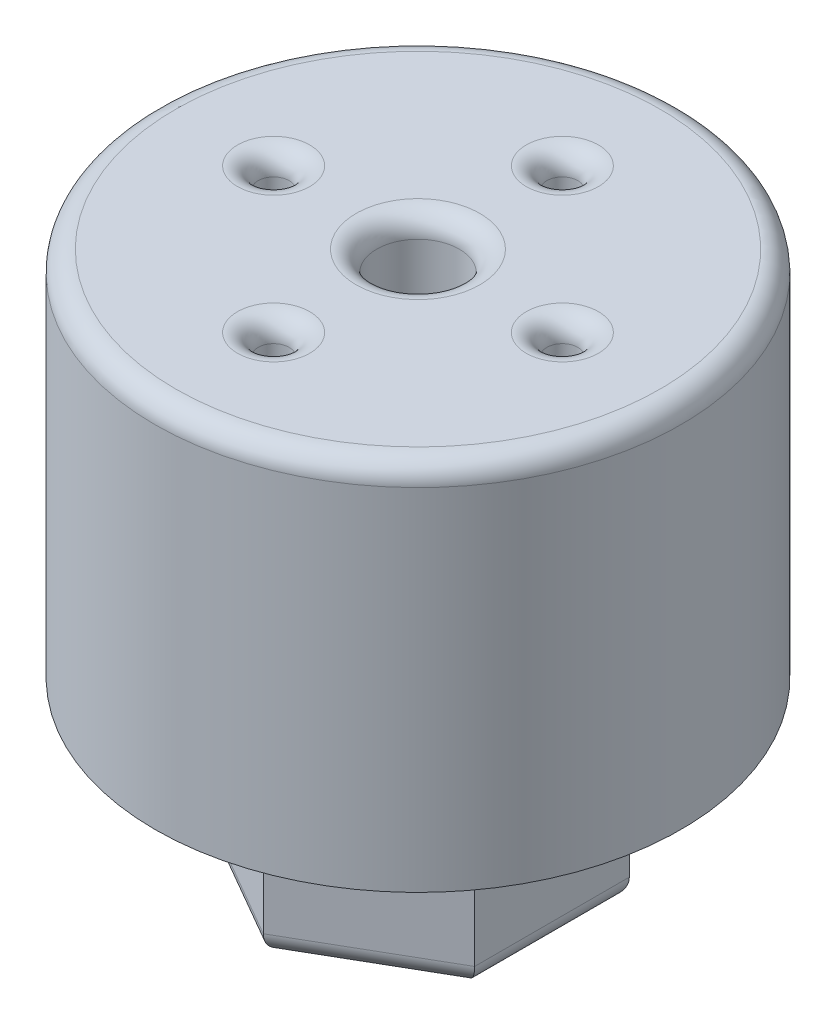
ISO-10303-21;
HEADER;
FILE_DESCRIPTION(('STEP AP214'),'2;1');
FILE_NAME('part.step','',(''),(''),'','','');
FILE_SCHEMA(('AUTOMOTIVE_DESIGN { 1 0 10303 214 1 1 1 1 }'));
ENDSEC;
DATA;
#1=APPLICATION_CONTEXT('core data for automotive mechanical design processes');
#2=APPLICATION_PROTOCOL_DEFINITION('international standard','automotive_design',2000,#1);
#3=PRODUCT_CONTEXT('',#1,'mechanical');
#4=PRODUCT('Part','Part','',(#3));
#5=PRODUCT_RELATED_PRODUCT_CATEGORY('part','',(#4));
#6=PRODUCT_DEFINITION_FORMATION('','',#4);
#7=PRODUCT_DEFINITION_CONTEXT('part definition',#1,'design');
#8=PRODUCT_DEFINITION('design','',#6,#7);
#9=PRODUCT_DEFINITION_SHAPE('','',#8);
#10=(LENGTH_UNIT() NAMED_UNIT(*) SI_UNIT(.MILLI.,.METRE.));
#11=(NAMED_UNIT(*) PLANE_ANGLE_UNIT() SI_UNIT($,.RADIAN.));
#12=(NAMED_UNIT(*) SI_UNIT($,.STERADIAN.) SOLID_ANGLE_UNIT());
#13=UNCERTAINTY_MEASURE_WITH_UNIT(LENGTH_MEASURE(1.E-05),#10,'distance_accuracy_value','');
#14=(GEOMETRIC_REPRESENTATION_CONTEXT(3) GLOBAL_UNCERTAINTY_ASSIGNED_CONTEXT((#13)) GLOBAL_UNIT_ASSIGNED_CONTEXT((#10,
#11,#12)) REPRESENTATION_CONTEXT('',''));
#15=CARTESIAN_POINT('',(0.,0.,0.));
#16=DIRECTION('',(0.,0.,1.));
#17=DIRECTION('',(1.,0.,0.));
#18=AXIS2_PLACEMENT_3D('',#15,#16,#17);
#19=CARTESIAN_POINT('',(0.,18.,-7.));
#20=DIRECTION('',(0.,-1.,0.));
#21=DIRECTION('',(0.,0.,-1.));
#22=AXIS2_PLACEMENT_3D('',#19,#20,#21);
#23=CYLINDRICAL_SURFACE('',#22,0.75);
#24=CARTESIAN_POINT('',(0.,17.,-7.));
#25=DIRECTION('',(0.,1.,0.));
#26=DIRECTION('',(0.,0.,1.));
#27=AXIS2_PLACEMENT_3D('',#24,#25,#26);
#28=CIRCLE('',#27,0.75);
#29=CARTESIAN_POINT('',(0.,17.,-6.25));
#30=VERTEX_POINT('',#29);
#31=EDGE_CURVE('E224',#30,#30,#28,.T.);
#32=ORIENTED_EDGE('',*,*,#31,.T.);
#33=EDGE_LOOP('',(#32));
#34=FACE_BOUND('',#33,.T.);
#35=CARTESIAN_POINT('',(0.,4.,-7.));
#36=DIRECTION('',(0.,-1.,0.));
#37=DIRECTION('',(0.,0.,-1.));
#38=AXIS2_PLACEMENT_3D('',#35,#36,#37);
#39=CIRCLE('',#38,0.75);
#40=CARTESIAN_POINT('',(0.,4.,-7.75));
#41=VERTEX_POINT('',#40);
#42=EDGE_CURVE('E567',#41,#41,#39,.T.);
#43=ORIENTED_EDGE('',*,*,#42,.T.);
#44=EDGE_LOOP('',(#43));
#45=FACE_BOUND('',#44,.T.);
#46=ADVANCED_FACE('F33',(#34,#45),#23,.F.);
#47=CARTESIAN_POINT('',(7.0000000000002,18.,-1.98094713253425E-13));
#48=DIRECTION('',(0.,-1.,0.));
#49=DIRECTION('',(0.,0.,-1.));
#50=AXIS2_PLACEMENT_3D('',#47,#48,#49);
#51=CYLINDRICAL_SURFACE('',#50,0.750000000000155);
#52=CARTESIAN_POINT('',(7.0000000000002,17.,-1.98094713253425E-13));
#53=DIRECTION('',(0.,1.,0.));
#54=DIRECTION('',(0.,0.,1.));
#55=AXIS2_PLACEMENT_3D('',#52,#53,#54);
#56=CIRCLE('',#55,0.750000000000155);
#57=CARTESIAN_POINT('',(7.0000000000002,17.,0.749999999999957));
#58=VERTEX_POINT('',#57);
#59=EDGE_CURVE('E218',#58,#58,#56,.T.);
#60=ORIENTED_EDGE('',*,*,#59,.T.);
#61=EDGE_LOOP('',(#60));
#62=FACE_BOUND('',#61,.T.);
#63=CARTESIAN_POINT('',(7.0000000000002,4.,-1.98094713253425E-13));
#64=DIRECTION('',(0.,-1.,0.));
#65=DIRECTION('',(0.,0.,-1.));
#66=AXIS2_PLACEMENT_3D('',#63,#64,#65);
#67=CIRCLE('',#66,0.750000000000155);
#68=CARTESIAN_POINT('',(7.0000000000002,4.,-0.750000000000353));
#69=VERTEX_POINT('',#68);
#70=EDGE_CURVE('E570',#69,#69,#67,.T.);
#71=ORIENTED_EDGE('',*,*,#70,.T.);
#72=EDGE_LOOP('',(#71));
#73=FACE_BOUND('',#72,.T.);
#74=ADVANCED_FACE('F246',(#62,#73),#51,.F.);
#75=CARTESIAN_POINT('',(3.9618942650685E-13,18.,7.));
#76=DIRECTION('',(0.,-1.,0.));
#77=DIRECTION('',(0.,0.,-1.));
#78=AXIS2_PLACEMENT_3D('',#75,#76,#77);
#79=CYLINDRICAL_SURFACE('',#78,0.750000000000425);
#80=CARTESIAN_POINT('',(3.9618942650685E-13,17.,7.));
#81=DIRECTION('',(0.,1.,0.));
#82=DIRECTION('',(0.,0.,1.));
#83=AXIS2_PLACEMENT_3D('',#80,#81,#82);
#84=CIRCLE('',#83,0.750000000000425);
#85=CARTESIAN_POINT('',(3.9618942650685E-13,17.,7.75000000000043));
#86=VERTEX_POINT('',#85);
#87=EDGE_CURVE('E41',#86,#86,#84,.T.);
#88=ORIENTED_EDGE('',*,*,#87,.T.);
#89=EDGE_LOOP('',(#88));
#90=FACE_BOUND('',#89,.T.);
#91=CARTESIAN_POINT('',(3.9618942650685E-13,4.,7.));
#92=DIRECTION('',(0.,-1.,0.));
#93=DIRECTION('',(0.,0.,-1.));
#94=AXIS2_PLACEMENT_3D('',#91,#92,#93);
#95=CIRCLE('',#94,0.750000000000425);
#96=CARTESIAN_POINT('',(3.9618942650685E-13,4.,6.24999999999957));
#97=VERTEX_POINT('',#96);
#98=EDGE_CURVE('E152',#97,#97,#95,.T.);
#99=ORIENTED_EDGE('',*,*,#98,.T.);
#100=EDGE_LOOP('',(#99));
#101=FACE_BOUND('',#100,.T.);
#102=ADVANCED_FACE('F229',(#90,#101),#79,.F.);
#103=CARTESIAN_POINT('',(-6.9999999999998,18.,1.98951966012828E-13));
#104=DIRECTION('',(0.,-1.,0.));
#105=DIRECTION('',(0.,0.,-1.));
#106=AXIS2_PLACEMENT_3D('',#103,#104,#105);
#107=CYLINDRICAL_SURFACE('',#106,0.750000000000318);
#108=CARTESIAN_POINT('',(-6.9999999999998,17.,1.98951966012828E-13));
#109=DIRECTION('',(0.,1.,0.));
#110=DIRECTION('',(0.,0.,1.));
#111=AXIS2_PLACEMENT_3D('',#108,#109,#110);
#112=CIRCLE('',#111,0.750000000000318);
#113=CARTESIAN_POINT('',(-6.9999999999998,17.,0.750000000000517));
#114=VERTEX_POINT('',#113);
#115=EDGE_CURVE('E182',#114,#114,#112,.T.);
#116=ORIENTED_EDGE('',*,*,#115,.T.);
#117=EDGE_LOOP('',(#116));
#118=FACE_BOUND('',#117,.T.);
#119=CARTESIAN_POINT('',(-6.9999999999998,4.,1.98951966012828E-13));
#120=DIRECTION('',(0.,-1.,0.));
#121=DIRECTION('',(0.,0.,-1.));
#122=AXIS2_PLACEMENT_3D('',#119,#120,#121);
#123=CIRCLE('',#122,0.750000000000318);
#124=CARTESIAN_POINT('',(-6.9999999999998,4.,-0.750000000000119));
#125=VERTEX_POINT('',#124);
#126=EDGE_CURVE('E149',#125,#125,#123,.T.);
#127=ORIENTED_EDGE('',*,*,#126,.T.);
#128=EDGE_LOOP('',(#127));
#129=FACE_BOUND('',#128,.T.);
#130=ADVANCED_FACE('F264',(#118,#129),#107,.F.);
#131=CARTESIAN_POINT('',(0.,0.,0.));
#132=DIRECTION('',(0.,1.,0.));
#133=DIRECTION('',(0.,0.,1.));
#134=AXIS2_PLACEMENT_3D('',#131,#132,#133);
#135=PLANE('',#134);
#136=CARTESIAN_POINT('',(0.,0.,0.));
#137=DIRECTION('',(0.,1.,0.));
#138=DIRECTION('',(0.,0.,1.));
#139=AXIS2_PLACEMENT_3D('',#136,#137,#138);
#140=CIRCLE('',#139,12.75);
#141=CARTESIAN_POINT('',(0.,0.,12.75));
#142=VERTEX_POINT('',#141);
#143=EDGE_CURVE('E146',#142,#142,#140,.T.);
#144=ORIENTED_EDGE('',*,*,#143,.F.);
#145=EDGE_LOOP('',(#144));
#146=FACE_BOUND('',#145,.T.);
#147=DIRECTION('',(-0.866025403784439,0.,0.5));
#148=VECTOR('',#147,1.);
#149=CARTESIAN_POINT('',(6.49519052838329,0.,3.75));
#150=LINE('',#149,#148);
#151=CARTESIAN_POINT('',(6.49519052838329,0.,3.75));
#152=VERTEX_POINT('',#151);
#153=CARTESIAN_POINT('',(0.,0.,7.5));
#154=VERTEX_POINT('',#153);
#155=EDGE_CURVE('E125',#152,#154,#150,.T.);
#156=ORIENTED_EDGE('',*,*,#155,.F.);
#157=DIRECTION('',(0.,0.,1.));
#158=VECTOR('',#157,1.);
#159=CARTESIAN_POINT('',(6.49519052838329,0.,-3.75));
#160=LINE('',#159,#158);
#161=CARTESIAN_POINT('',(6.49519052838329,0.,-3.75));
#162=VERTEX_POINT('',#161);
#163=EDGE_CURVE('E131',#162,#152,#160,.T.);
#164=ORIENTED_EDGE('',*,*,#163,.F.);
#165=DIRECTION('',(0.866025403784438,0.,0.5));
#166=VECTOR('',#165,1.);
#167=CARTESIAN_POINT('',(0.,0.,-7.5));
#168=LINE('',#167,#166);
#169=CARTESIAN_POINT('',(0.,0.,-7.5));
#170=VERTEX_POINT('',#169);
#171=EDGE_CURVE('E110',#170,#162,#168,.T.);
#172=ORIENTED_EDGE('',*,*,#171,.F.);
#173=DIRECTION('',(0.866025403784439,0.,-0.5));
#174=VECTOR('',#173,1.);
#175=CARTESIAN_POINT('',(-6.49519052838329,0.,-3.75));
#176=LINE('',#175,#174);
#177=CARTESIAN_POINT('',(-6.49519052838329,0.,-3.75));
#178=VERTEX_POINT('',#177);
#179=EDGE_CURVE('E119',#178,#170,#176,.T.);
#180=ORIENTED_EDGE('',*,*,#179,.F.);
#181=DIRECTION('',(0.,0.,-1.));
#182=VECTOR('',#181,1.);
#183=CARTESIAN_POINT('',(-6.49519052838329,0.,3.75));
#184=LINE('',#183,#182);
#185=CARTESIAN_POINT('',(-6.49519052838329,0.,3.75));
#186=VERTEX_POINT('',#185);
#187=EDGE_CURVE('E132',#186,#178,#184,.T.);
#188=ORIENTED_EDGE('',*,*,#187,.F.);
#189=DIRECTION('',(-0.866025403784439,0.,-0.5));
#190=VECTOR('',#189,1.);
#191=CARTESIAN_POINT('',(0.,0.,7.5));
#192=LINE('',#191,#190);
#193=EDGE_CURVE('E136',#154,#186,#192,.T.);
#194=ORIENTED_EDGE('',*,*,#193,.F.);
#195=EDGE_LOOP('',(#156,#164,#172,#180,#188,#194));
#196=FACE_BOUND('',#195,.T.);
#197=ADVANCED_FACE('F129',(#146,#196),#135,.F.);
#198=CARTESIAN_POINT('',(0.,18.,0.));
#199=DIRECTION('',(0.,1.,0.));
#200=DIRECTION('',(0.,0.,1.));
#201=AXIS2_PLACEMENT_3D('',#198,#199,#200);
#202=PLANE('',#201);
#203=CARTESIAN_POINT('',(-6.9999999999998,18.,1.98951966012828E-13));
#204=DIRECTION('',(0.,1.,0.));
#205=DIRECTION('',(0.,0.,1.));
#206=AXIS2_PLACEMENT_3D('',#203,#204,#205);
#207=CIRCLE('',#206,1.75000000000032);
#208=CARTESIAN_POINT('',(-6.9999999999998,18.,1.75000000000052));
#209=VERTEX_POINT('',#208);
#210=EDGE_CURVE('E215',#209,#209,#207,.F.);
#211=ORIENTED_EDGE('',*,*,#210,.T.);
#212=EDGE_LOOP('',(#211));
#213=FACE_BOUND('',#212,.T.);
#214=CARTESIAN_POINT('',(7.0000000000002,18.,-1.98094713253425E-13));
#215=DIRECTION('',(0.,1.,0.));
#216=DIRECTION('',(0.,0.,1.));
#217=AXIS2_PLACEMENT_3D('',#214,#215,#216);
#218=CIRCLE('',#217,1.75000000000015);
#219=CARTESIAN_POINT('',(7.0000000000002,18.,1.74999999999996));
#220=VERTEX_POINT('',#219);
#221=EDGE_CURVE('E212',#220,#220,#218,.F.);
#222=ORIENTED_EDGE('',*,*,#221,.T.);
#223=EDGE_LOOP('',(#222));
#224=FACE_BOUND('',#223,.T.);
#225=CARTESIAN_POINT('',(0.,18.,0.));
#226=DIRECTION('',(0.,1.,0.));
#227=DIRECTION('',(0.,0.,1.));
#228=AXIS2_PLACEMENT_3D('',#225,#226,#227);
#229=CIRCLE('',#228,11.75);
#230=CARTESIAN_POINT('',(0.,18.,11.75));
#231=VERTEX_POINT('',#230);
#232=EDGE_CURVE('E209',#231,#231,#229,.T.);
#233=ORIENTED_EDGE('',*,*,#232,.T.);
#234=EDGE_LOOP('',(#233));
#235=FACE_BOUND('',#234,.T.);
#236=CARTESIAN_POINT('',(0.,18.,-7.));
#237=DIRECTION('',(0.,1.,0.));
#238=DIRECTION('',(0.,0.,1.));
#239=AXIS2_PLACEMENT_3D('',#236,#237,#238);
#240=CIRCLE('',#239,1.75);
#241=CARTESIAN_POINT('',(0.,18.,-5.25));
#242=VERTEX_POINT('',#241);
#243=EDGE_CURVE('E206',#242,#242,#240,.F.);
#244=ORIENTED_EDGE('',*,*,#243,.T.);
#245=EDGE_LOOP('',(#244));
#246=FACE_BOUND('',#245,.T.);
#247=CARTESIAN_POINT('',(3.9618942650685E-13,18.,7.));
#248=DIRECTION('',(0.,1.,0.));
#249=DIRECTION('',(0.,0.,1.));
#250=AXIS2_PLACEMENT_3D('',#247,#248,#249);
#251=CIRCLE('',#250,1.75000000000043);
#252=CARTESIAN_POINT('',(3.9618942650685E-13,18.,8.75000000000043));
#253=VERTEX_POINT('',#252);
#254=EDGE_CURVE('E203',#253,#253,#251,.F.);
#255=ORIENTED_EDGE('',*,*,#254,.T.);
#256=EDGE_LOOP('',(#255));
#257=FACE_BOUND('',#256,.T.);
#258=CARTESIAN_POINT('',(0.,18.,0.));
#259=DIRECTION('',(0.,1.,0.));
#260=DIRECTION('',(0.,0.,1.));
#261=AXIS2_PLACEMENT_3D('',#258,#259,#260);
#262=CIRCLE('',#261,3.);
#263=CARTESIAN_POINT('',(0.,18.,3.));
#264=VERTEX_POINT('',#263);
#265=EDGE_CURVE('E200',#264,#264,#262,.F.);
#266=ORIENTED_EDGE('',*,*,#265,.T.);
#267=EDGE_LOOP('',(#266));
#268=FACE_BOUND('',#267,.T.);
#269=ADVANCED_FACE('F257',(#213,#224,#235,#246,#257,#268),#202,.T.);
#270=CARTESIAN_POINT('',(0.,18.,0.));
#271=DIRECTION('',(0.,-1.,0.));
#272=DIRECTION('',(0.,0.,-1.));
#273=AXIS2_PLACEMENT_3D('',#270,#271,#272);
#274=CYLINDRICAL_SURFACE('',#273,12.75);
#275=CARTESIAN_POINT('',(0.,17.,0.));
#276=DIRECTION('',(0.,1.,0.));
#277=DIRECTION('',(0.,0.,1.));
#278=AXIS2_PLACEMENT_3D('',#275,#276,#277);
#279=CIRCLE('',#278,12.75);
#280=CARTESIAN_POINT('',(0.,17.,12.75));
#281=VERTEX_POINT('',#280);
#282=EDGE_CURVE('E221',#281,#281,#279,.F.);
#283=ORIENTED_EDGE('',*,*,#282,.T.);
#284=EDGE_LOOP('',(#283));
#285=FACE_BOUND('',#284,.T.);
#286=ORIENTED_EDGE('',*,*,#143,.T.);
#287=EDGE_LOOP('',(#286));
#288=FACE_BOUND('',#287,.T.);
#289=ADVANCED_FACE('F260',(#285,#288),#274,.T.);
#290=CARTESIAN_POINT('',(6.49519052838329,-8.,3.75));
#291=DIRECTION('',(-0.5,0.,-0.866025403784439));
#292=DIRECTION('',(-0.866025403784439,0.,0.5));
#293=AXIS2_PLACEMENT_3D('',#290,#291,#292);
#294=PLANE('',#293);
#295=DIRECTION('',(0.,1.,0.));
#296=VECTOR('',#295,1.);
#297=CARTESIAN_POINT('',(0.,-8.,7.5));
#298=LINE('',#297,#296);
#299=CARTESIAN_POINT('',(0.,-7.,7.5));
#300=VERTEX_POINT('',#299);
#301=EDGE_CURVE('E144',#300,#154,#298,.T.);
#302=ORIENTED_EDGE('',*,*,#301,.F.);
#303=DIRECTION('',(-0.866025403784439,0.,0.5));
#304=VECTOR('',#303,1.);
#305=CARTESIAN_POINT('',(6.49519052838329,-7.,3.75));
#306=LINE('',#305,#304);
#307=CARTESIAN_POINT('',(6.49519052838329,-7.,3.75));
#308=VERTEX_POINT('',#307);
#309=EDGE_CURVE('E177',#300,#308,#306,.F.);
#310=ORIENTED_EDGE('',*,*,#309,.T.);
#311=DIRECTION('',(0.,1.,0.));
#312=VECTOR('',#311,1.);
#313=CARTESIAN_POINT('',(6.49519052838329,-8.,3.75));
#314=LINE('',#313,#312);
#315=EDGE_CURVE('E124',#308,#152,#314,.T.);
#316=ORIENTED_EDGE('',*,*,#315,.T.);
#317=ORIENTED_EDGE('',*,*,#155,.T.);
#318=EDGE_LOOP('',(#302,#310,#316,#317));
#319=FACE_BOUND('',#318,.T.);
#320=ADVANCED_FACE('F268',(#319),#294,.F.);
#321=CARTESIAN_POINT('',(0.,-8.,7.5));
#322=DIRECTION('',(0.5,0.,-0.866025403784439));
#323=DIRECTION('',(-0.866025403784439,0.,-0.5));
#324=AXIS2_PLACEMENT_3D('',#321,#322,#323);
#325=PLANE('',#324);
#326=DIRECTION('',(0.,1.,0.));
#327=VECTOR('',#326,1.);
#328=CARTESIAN_POINT('',(-6.49519052838329,-8.,3.75));
#329=LINE('',#328,#327);
#330=CARTESIAN_POINT('',(-6.49519052838329,-7.,3.75));
#331=VERTEX_POINT('',#330);
#332=EDGE_CURVE('E142',#331,#186,#329,.T.);
#333=ORIENTED_EDGE('',*,*,#332,.F.);
#334=DIRECTION('',(-0.866025403784439,0.,-0.5));
#335=VECTOR('',#334,1.);
#336=CARTESIAN_POINT('',(0.,-7.,7.5));
#337=LINE('',#336,#335);
#338=EDGE_CURVE('E48',#331,#300,#337,.F.);
#339=ORIENTED_EDGE('',*,*,#338,.T.);
#340=ORIENTED_EDGE('',*,*,#301,.T.);
#341=ORIENTED_EDGE('',*,*,#193,.T.);
#342=EDGE_LOOP('',(#333,#339,#340,#341));
#343=FACE_BOUND('',#342,.T.);
#344=ADVANCED_FACE('F507',(#343),#325,.F.);
#345=CARTESIAN_POINT('',(-6.49519052838329,-8.,3.75));
#346=DIRECTION('',(1.,0.,0.));
#347=DIRECTION('',(0.,0.,-1.));
#348=AXIS2_PLACEMENT_3D('',#345,#346,#347);
#349=PLANE('',#348);
#350=DIRECTION('',(0.,1.,0.));
#351=VECTOR('',#350,1.);
#352=CARTESIAN_POINT('',(-6.49519052838329,-8.,-3.75));
#353=LINE('',#352,#351);
#354=CARTESIAN_POINT('',(-6.49519052838329,-7.,-3.75));
#355=VERTEX_POINT('',#354);
#356=EDGE_CURVE('E115',#355,#178,#353,.T.);
#357=ORIENTED_EDGE('',*,*,#356,.F.);
#358=DIRECTION('',(0.,0.,-1.));
#359=VECTOR('',#358,1.);
#360=CARTESIAN_POINT('',(-6.49519052838329,-7.,3.75));
#361=LINE('',#360,#359);
#362=EDGE_CURVE('E56',#355,#331,#361,.F.);
#363=ORIENTED_EDGE('',*,*,#362,.T.);
#364=ORIENTED_EDGE('',*,*,#332,.T.);
#365=ORIENTED_EDGE('',*,*,#187,.T.);
#366=EDGE_LOOP('',(#357,#363,#364,#365));
#367=FACE_BOUND('',#366,.T.);
#368=ADVANCED_FACE('F499',(#367),#349,.F.);
#369=CARTESIAN_POINT('',(-6.49519052838329,-8.,-3.75));
#370=DIRECTION('',(0.5,0.,0.866025403784439));
#371=DIRECTION('',(0.866025403784439,0.,-0.5));
#372=AXIS2_PLACEMENT_3D('',#369,#370,#371);
#373=PLANE('',#372);
#374=DIRECTION('',(0.,1.,0.));
#375=VECTOR('',#374,1.);
#376=CARTESIAN_POINT('',(0.,-8.,-7.5));
#377=LINE('',#376,#375);
#378=CARTESIAN_POINT('',(0.,-7.,-7.5));
#379=VERTEX_POINT('',#378);
#380=EDGE_CURVE('E105',#379,#170,#377,.T.);
#381=ORIENTED_EDGE('',*,*,#380,.F.);
#382=DIRECTION('',(0.866025403784439,0.,-0.5));
#383=VECTOR('',#382,1.);
#384=CARTESIAN_POINT('',(-6.49519052838329,-7.,-3.75));
#385=LINE('',#384,#383);
#386=EDGE_CURVE('E173',#379,#355,#385,.F.);
#387=ORIENTED_EDGE('',*,*,#386,.T.);
#388=ORIENTED_EDGE('',*,*,#356,.T.);
#389=ORIENTED_EDGE('',*,*,#179,.T.);
#390=EDGE_LOOP('',(#381,#387,#388,#389));
#391=FACE_BOUND('',#390,.T.);
#392=ADVANCED_FACE('F120',(#391),#373,.F.);
#393=CARTESIAN_POINT('',(0.,-8.,-7.5));
#394=DIRECTION('',(-0.5,0.,0.866025403784439));
#395=DIRECTION('',(0.866025403784438,0.,0.5));
#396=AXIS2_PLACEMENT_3D('',#393,#394,#395);
#397=PLANE('',#396);
#398=DIRECTION('',(0.,1.,0.));
#399=VECTOR('',#398,1.);
#400=CARTESIAN_POINT('',(6.49519052838329,-8.,-3.75));
#401=LINE('',#400,#399);
#402=CARTESIAN_POINT('',(6.49519052838329,-7.,-3.75));
#403=VERTEX_POINT('',#402);
#404=EDGE_CURVE('E116',#403,#162,#401,.T.);
#405=ORIENTED_EDGE('',*,*,#404,.F.);
#406=DIRECTION('',(0.866025403784438,0.,0.5));
#407=VECTOR('',#406,1.);
#408=CARTESIAN_POINT('',(0.,-7.,-7.5));
#409=LINE('',#408,#407);
#410=EDGE_CURVE('E112',#403,#379,#409,.F.);
#411=ORIENTED_EDGE('',*,*,#410,.T.);
#412=ORIENTED_EDGE('',*,*,#380,.T.);
#413=ORIENTED_EDGE('',*,*,#171,.T.);
#414=EDGE_LOOP('',(#405,#411,#412,#413));
#415=FACE_BOUND('',#414,.T.);
#416=ADVANCED_FACE('F108',(#415),#397,.F.);
#417=CARTESIAN_POINT('',(6.49519052838329,-8.,-3.75));
#418=DIRECTION('',(-1.,0.,0.));
#419=DIRECTION('',(0.,0.,1.));
#420=AXIS2_PLACEMENT_3D('',#417,#418,#419);
#421=PLANE('',#420);
#422=ORIENTED_EDGE('',*,*,#315,.F.);
#423=DIRECTION('',(0.,0.,1.));
#424=VECTOR('',#423,1.);
#425=CARTESIAN_POINT('',(6.49519052838329,-7.,-3.75));
#426=LINE('',#425,#424);
#427=EDGE_CURVE('E169',#308,#403,#426,.F.);
#428=ORIENTED_EDGE('',*,*,#427,.T.);
#429=ORIENTED_EDGE('',*,*,#404,.T.);
#430=ORIENTED_EDGE('',*,*,#163,.T.);
#431=EDGE_LOOP('',(#422,#428,#429,#430));
#432=FACE_BOUND('',#431,.T.);
#433=ADVANCED_FACE('F475',(#432),#421,.F.);
#434=CARTESIAN_POINT('',(0.,-8.,0.));
#435=DIRECTION('',(0.,-1.,0.));
#436=DIRECTION('',(0.,0.,-1.));
#437=AXIS2_PLACEMENT_3D('',#434,#435,#436);
#438=PLANE('',#437);
#439=DIRECTION('',(0.866025403784438,0.,0.5));
#440=VECTOR('',#439,1.);
#441=CARTESIAN_POINT('',(5.99519052838329,-8.,-2.88397459621556));
#442=LINE('',#441,#440);
#443=CARTESIAN_POINT('',(0.,-8.,-6.34529946162075));
#444=VERTEX_POINT('',#443);
#445=CARTESIAN_POINT('',(5.49519052838329,-8.,-3.17264973081037));
#446=VERTEX_POINT('',#445);
#447=EDGE_CURVE('E164',#444,#446,#442,.T.);
#448=ORIENTED_EDGE('',*,*,#447,.T.);
#449=DIRECTION('',(0.,0.,1.));
#450=VECTOR('',#449,1.);
#451=CARTESIAN_POINT('',(5.49519052838329,-8.,3.75));
#452=LINE('',#451,#450);
#453=CARTESIAN_POINT('',(5.49519052838329,-8.,3.17264973081038));
#454=VERTEX_POINT('',#453);
#455=EDGE_CURVE('E166',#446,#454,#452,.T.);
#456=ORIENTED_EDGE('',*,*,#455,.T.);
#457=DIRECTION('',(-0.866025403784439,0.,0.5));
#458=VECTOR('',#457,1.);
#459=CARTESIAN_POINT('',(-0.499999999999998,-8.,6.63397459621556));
#460=LINE('',#459,#458);
#461=CARTESIAN_POINT('',(0.,-8.,6.34529946162075));
#462=VERTEX_POINT('',#461);
#463=EDGE_CURVE('E156',#454,#462,#460,.T.);
#464=ORIENTED_EDGE('',*,*,#463,.T.);
#465=DIRECTION('',(-0.866025403784439,0.,-0.5));
#466=VECTOR('',#465,1.);
#467=CARTESIAN_POINT('',(-5.99519052838329,-8.,2.88397459621556));
#468=LINE('',#467,#466);
#469=CARTESIAN_POINT('',(-5.49519052838329,-8.,3.17264973081037));
#470=VERTEX_POINT('',#469);
#471=EDGE_CURVE('E158',#462,#470,#468,.T.);
#472=ORIENTED_EDGE('',*,*,#471,.T.);
#473=DIRECTION('',(0.,0.,-1.));
#474=VECTOR('',#473,1.);
#475=CARTESIAN_POINT('',(-5.49519052838329,-8.,-3.75));
#476=LINE('',#475,#474);
#477=CARTESIAN_POINT('',(-5.49519052838329,-8.,-3.17264973081037));
#478=VERTEX_POINT('',#477);
#479=EDGE_CURVE('E160',#470,#478,#476,.T.);
#480=ORIENTED_EDGE('',*,*,#479,.T.);
#481=DIRECTION('',(0.866025403784439,0.,-0.5));
#482=VECTOR('',#481,1.);
#483=CARTESIAN_POINT('',(0.499999999999999,-8.,-6.63397459621556));
#484=LINE('',#483,#482);
#485=EDGE_CURVE('E162',#478,#444,#484,.T.);
#486=ORIENTED_EDGE('',*,*,#485,.T.);
#487=EDGE_LOOP('',(#448,#456,#464,#472,#480,#486));
#488=FACE_BOUND('',#487,.T.);
#489=CARTESIAN_POINT('',(0.,-8.,0.));
#490=DIRECTION('',(0.,-1.,0.));
#491=DIRECTION('',(0.,0.,-1.));
#492=AXIS2_PLACEMENT_3D('',#489,#490,#491);
#493=CIRCLE('',#492,3.);
#494=CARTESIAN_POINT('',(0.,-8.,-3.));
#495=VERTEX_POINT('',#494);
#496=EDGE_CURVE('E134',#495,#495,#493,.F.);
#497=ORIENTED_EDGE('',*,*,#496,.T.);
#498=EDGE_LOOP('',(#497));
#499=FACE_BOUND('',#498,.T.);
#500=ADVANCED_FACE('F434',(#488,#499),#438,.T.);
#501=CARTESIAN_POINT('',(0.,4.,0.));
#502=DIRECTION('',(0.,-1.,0.));
#503=DIRECTION('',(0.,0.,-1.));
#504=AXIS2_PLACEMENT_3D('',#501,#502,#503);
#505=PLANE('',#504);
#506=ORIENTED_EDGE('',*,*,#126,.F.);
#507=EDGE_LOOP('',(#506));
#508=FACE_BOUND('',#507,.T.);
#509=ADVANCED_FACE('F411',(#508),#505,.F.);
#510=ORIENTED_EDGE('',*,*,#98,.F.);
#511=EDGE_LOOP('',(#510));
#512=FACE_BOUND('',#511,.T.);
#513=ADVANCED_FACE('F419',(#512),#505,.F.);
#514=ORIENTED_EDGE('',*,*,#70,.F.);
#515=EDGE_LOOP('',(#514));
#516=FACE_BOUND('',#515,.T.);
#517=ADVANCED_FACE('F408',(#516),#505,.F.);
#518=ORIENTED_EDGE('',*,*,#42,.F.);
#519=EDGE_LOOP('',(#518));
#520=FACE_BOUND('',#519,.T.);
#521=ADVANCED_FACE('F398',(#520),#505,.F.);
#522=CARTESIAN_POINT('',(0.,18.,0.));
#523=DIRECTION('',(0.,-1.,0.));
#524=DIRECTION('',(0.,0.,-1.));
#525=AXIS2_PLACEMENT_3D('',#522,#523,#524);
#526=CYLINDRICAL_SURFACE('',#525,2.);
#527=CARTESIAN_POINT('',(0.,17.,0.));
#528=DIRECTION('',(0.,1.,0.));
#529=DIRECTION('',(0.,0.,1.));
#530=AXIS2_PLACEMENT_3D('',#527,#528,#529);
#531=CIRCLE('',#530,2.);
#532=CARTESIAN_POINT('',(0.,17.,2.));
#533=VERTEX_POINT('',#532);
#534=EDGE_CURVE('E11',#533,#533,#531,.T.);
#535=ORIENTED_EDGE('',*,*,#534,.T.);
#536=EDGE_LOOP('',(#535));
#537=FACE_BOUND('',#536,.T.);
#538=CARTESIAN_POINT('',(0.,-7.,0.));
#539=DIRECTION('',(0.,-1.,0.));
#540=DIRECTION('',(0.,0.,-1.));
#541=AXIS2_PLACEMENT_3D('',#538,#539,#540);
#542=CIRCLE('',#541,2.);
#543=CARTESIAN_POINT('',(0.,-7.,-2.));
#544=VERTEX_POINT('',#543);
#545=EDGE_CURVE('E179',#544,#544,#542,.T.);
#546=ORIENTED_EDGE('',*,*,#545,.T.);
#547=EDGE_LOOP('',(#546));
#548=FACE_BOUND('',#547,.T.);
#549=ADVANCED_FACE('F294',(#537,#548),#526,.F.);
#550=CARTESIAN_POINT('',(-5.49519052838329,-7.,0.));
#551=DIRECTION('',(0.,0.,1.));
#552=DIRECTION('',(1.,0.,0.));
#553=AXIS2_PLACEMENT_3D('',#550,#551,#552);
#554=CYLINDRICAL_SURFACE('',#553,1.);
#555=CARTESIAN_POINT('',(-5.49519052838329,-7.,3.17264973081037));
#556=DIRECTION('',(0.5,0.,0.866025403784439));
#557=DIRECTION('',(0.866025403784439,0.,-0.5));
#558=AXIS2_PLACEMENT_3D('',#555,#556,#557);
#559=ELLIPSE('',#558,1.15470053837925,1.);
#560=EDGE_CURVE('E193',#331,#470,#559,.T.);
#561=ORIENTED_EDGE('',*,*,#560,.F.);
#562=ORIENTED_EDGE('',*,*,#362,.F.);
#563=CARTESIAN_POINT('',(-5.49519052838329,-7.,-3.17264973081037));
#564=DIRECTION('',(-0.5,0.,0.866025403784439));
#565=DIRECTION('',(0.866025403784439,0.,0.5));
#566=AXIS2_PLACEMENT_3D('',#563,#564,#565);
#567=ELLIPSE('',#566,1.15470053837925,1.);
#568=EDGE_CURVE('E153',#478,#355,#567,.F.);
#569=ORIENTED_EDGE('',*,*,#568,.F.);
#570=ORIENTED_EDGE('',*,*,#479,.F.);
#571=EDGE_LOOP('',(#561,#562,#569,#570));
#572=FACE_BOUND('',#571,.T.);
#573=ADVANCED_FACE('F290',(#572),#554,.T.);
#574=CARTESIAN_POINT('',(-2.74759526419165,-7.,-4.75897459621556));
#575=DIRECTION('',(-0.866025403784439,0.,0.5));
#576=DIRECTION('',(0.5,0.,0.866025403784439));
#577=AXIS2_PLACEMENT_3D('',#574,#575,#576);
#578=CYLINDRICAL_SURFACE('',#577,1.);
#579=ORIENTED_EDGE('',*,*,#568,.T.);
#580=ORIENTED_EDGE('',*,*,#386,.F.);
#581=CARTESIAN_POINT('',(0.,-7.,-6.34529946162075));
#582=DIRECTION('',(-1.,0.,0.));
#583=DIRECTION('',(0.,0.,1.));
#584=AXIS2_PLACEMENT_3D('',#581,#582,#583);
#585=ELLIPSE('',#584,1.15470053837925,1.);
#586=EDGE_CURVE('E190',#444,#379,#585,.F.);
#587=ORIENTED_EDGE('',*,*,#586,.F.);
#588=ORIENTED_EDGE('',*,*,#485,.F.);
#589=EDGE_LOOP('',(#579,#580,#587,#588));
#590=FACE_BOUND('',#589,.T.);
#591=ADVANCED_FACE('F286',(#590),#578,.T.);
#592=CARTESIAN_POINT('',(-2.74759526419164,-7.,4.75897459621556));
#593=DIRECTION('',(0.866025403784439,0.,0.5));
#594=DIRECTION('',(0.5,0.,-0.866025403784439));
#595=AXIS2_PLACEMENT_3D('',#592,#593,#594);
#596=CYLINDRICAL_SURFACE('',#595,1.);
#597=ORIENTED_EDGE('',*,*,#560,.T.);
#598=ORIENTED_EDGE('',*,*,#471,.F.);
#599=CARTESIAN_POINT('',(0.,-7.,6.34529946162075));
#600=DIRECTION('',(1.,0.,0.));
#601=DIRECTION('',(0.,0.,-1.));
#602=AXIS2_PLACEMENT_3D('',#599,#600,#601);
#603=ELLIPSE('',#602,1.15470053837925,1.);
#604=EDGE_CURVE('E187',#300,#462,#603,.T.);
#605=ORIENTED_EDGE('',*,*,#604,.F.);
#606=ORIENTED_EDGE('',*,*,#338,.F.);
#607=EDGE_LOOP('',(#597,#598,#605,#606));
#608=FACE_BOUND('',#607,.T.);
#609=ADVANCED_FACE('F282',(#608),#596,.T.);
#610=CARTESIAN_POINT('',(2.74759526419164,-7.,-4.75897459621556));
#611=DIRECTION('',(-0.866025403784438,0.,-0.5));
#612=DIRECTION('',(-0.5,0.,0.866025403784439));
#613=AXIS2_PLACEMENT_3D('',#610,#611,#612);
#614=CYLINDRICAL_SURFACE('',#613,1.);
#615=ORIENTED_EDGE('',*,*,#586,.T.);
#616=ORIENTED_EDGE('',*,*,#410,.F.);
#617=CARTESIAN_POINT('',(5.49519052838329,-7.,-3.17264973081037));
#618=DIRECTION('',(-0.5,0.,-0.866025403784439));
#619=DIRECTION('',(-0.866025403784439,0.,0.5));
#620=AXIS2_PLACEMENT_3D('',#617,#618,#619);
#621=ELLIPSE('',#620,1.15470053837925,1.);
#622=EDGE_CURVE('E185',#446,#403,#621,.F.);
#623=ORIENTED_EDGE('',*,*,#622,.F.);
#624=ORIENTED_EDGE('',*,*,#447,.F.);
#625=EDGE_LOOP('',(#615,#616,#623,#624));
#626=FACE_BOUND('',#625,.T.);
#627=ADVANCED_FACE('F278',(#626),#614,.T.);
#628=CARTESIAN_POINT('',(2.74759526419165,-7.,4.75897459621556));
#629=DIRECTION('',(0.866025403784439,0.,-0.5));
#630=DIRECTION('',(-0.5,0.,-0.866025403784439));
#631=AXIS2_PLACEMENT_3D('',#628,#629,#630);
#632=CYLINDRICAL_SURFACE('',#631,1.);
#633=ORIENTED_EDGE('',*,*,#604,.T.);
#634=ORIENTED_EDGE('',*,*,#463,.F.);
#635=CARTESIAN_POINT('',(5.49519052838329,-7.,3.17264973081038));
#636=DIRECTION('',(0.5,0.,-0.866025403784439));
#637=DIRECTION('',(0.866025403784439,0.,0.5));
#638=AXIS2_PLACEMENT_3D('',#635,#636,#637);
#639=ELLIPSE('',#638,1.15470053837925,1.);
#640=EDGE_CURVE('E183',#308,#454,#639,.T.);
#641=ORIENTED_EDGE('',*,*,#640,.F.);
#642=ORIENTED_EDGE('',*,*,#309,.F.);
#643=EDGE_LOOP('',(#633,#634,#641,#642));
#644=FACE_BOUND('',#643,.T.);
#645=ADVANCED_FACE('F274',(#644),#632,.T.);
#646=CARTESIAN_POINT('',(5.49519052838329,-7.,0.));
#647=DIRECTION('',(0.,0.,-1.));
#648=DIRECTION('',(-1.,0.,0.));
#649=AXIS2_PLACEMENT_3D('',#646,#647,#648);
#650=CYLINDRICAL_SURFACE('',#649,1.);
#651=ORIENTED_EDGE('',*,*,#622,.T.);
#652=ORIENTED_EDGE('',*,*,#427,.F.);
#653=ORIENTED_EDGE('',*,*,#640,.T.);
#654=ORIENTED_EDGE('',*,*,#455,.F.);
#655=EDGE_LOOP('',(#651,#652,#653,#654));
#656=FACE_BOUND('',#655,.T.);
#657=ADVANCED_FACE('F270',(#656),#650,.T.);
#658=CARTESIAN_POINT('',(0.,-7.,0.));
#659=DIRECTION('',(0.,-1.,0.));
#660=DIRECTION('',(0.,0.,-1.));
#661=AXIS2_PLACEMENT_3D('',#658,#659,#660);
#662=TOROIDAL_SURFACE('',#661,3.,1.);
#663=ORIENTED_EDGE('',*,*,#496,.F.);
#664=EDGE_LOOP('',(#663));
#665=FACE_BOUND('',#664,.T.);
#666=ORIENTED_EDGE('',*,*,#545,.F.);
#667=EDGE_LOOP('',(#666));
#668=FACE_BOUND('',#667,.T.);
#669=ADVANCED_FACE('F273',(#665,#668),#662,.T.);
#670=CARTESIAN_POINT('',(-6.9999999999998,17.,1.98951966012828E-13));
#671=DIRECTION('',(0.,1.,0.));
#672=DIRECTION('',(0.,0.,1.));
#673=AXIS2_PLACEMENT_3D('',#670,#671,#672);
#674=TOROIDAL_SURFACE('',#673,1.75000000000032,1.);
#675=ORIENTED_EDGE('',*,*,#210,.F.);
#676=EDGE_LOOP('',(#675));
#677=FACE_BOUND('',#676,.T.);
#678=ORIENTED_EDGE('',*,*,#115,.F.);
#679=EDGE_LOOP('',(#678));
#680=FACE_BOUND('',#679,.T.);
#681=ADVANCED_FACE('F298',(#677,#680),#674,.T.);
#682=CARTESIAN_POINT('',(7.0000000000002,17.,-1.98094713253425E-13));
#683=DIRECTION('',(0.,1.,0.));
#684=DIRECTION('',(0.,0.,1.));
#685=AXIS2_PLACEMENT_3D('',#682,#683,#684);
#686=TOROIDAL_SURFACE('',#685,1.75000000000015,1.);
#687=ORIENTED_EDGE('',*,*,#221,.F.);
#688=EDGE_LOOP('',(#687));
#689=FACE_BOUND('',#688,.T.);
#690=ORIENTED_EDGE('',*,*,#59,.F.);
#691=EDGE_LOOP('',(#690));
#692=FACE_BOUND('',#691,.T.);
#693=ADVANCED_FACE('F302',(#689,#692),#686,.T.);
#694=CARTESIAN_POINT('',(0.,17.,0.));
#695=DIRECTION('',(0.,1.,0.));
#696=DIRECTION('',(0.,0.,1.));
#697=AXIS2_PLACEMENT_3D('',#694,#695,#696);
#698=TOROIDAL_SURFACE('',#697,11.75,1.);
#699=ORIENTED_EDGE('',*,*,#282,.F.);
#700=EDGE_LOOP('',(#699));
#701=FACE_BOUND('',#700,.T.);
#702=ORIENTED_EDGE('',*,*,#232,.F.);
#703=EDGE_LOOP('',(#702));
#704=FACE_BOUND('',#703,.T.);
#705=ADVANCED_FACE('F241',(#701,#704),#698,.T.);
#706=CARTESIAN_POINT('',(0.,17.,-7.));
#707=DIRECTION('',(0.,1.,0.));
#708=DIRECTION('',(0.,0.,1.));
#709=AXIS2_PLACEMENT_3D('',#706,#707,#708);
#710=TOROIDAL_SURFACE('',#709,1.75,1.);
#711=ORIENTED_EDGE('',*,*,#243,.F.);
#712=EDGE_LOOP('',(#711));
#713=FACE_BOUND('',#712,.T.);
#714=ORIENTED_EDGE('',*,*,#31,.F.);
#715=EDGE_LOOP('',(#714));
#716=FACE_BOUND('',#715,.T.);
#717=ADVANCED_FACE('F234',(#713,#716),#710,.T.);
#718=CARTESIAN_POINT('',(3.9618942650685E-13,17.,7.));
#719=DIRECTION('',(0.,1.,0.));
#720=DIRECTION('',(0.,0.,1.));
#721=AXIS2_PLACEMENT_3D('',#718,#719,#720);
#722=TOROIDAL_SURFACE('',#721,1.75000000000043,1.);
#723=ORIENTED_EDGE('',*,*,#254,.F.);
#724=EDGE_LOOP('',(#723));
#725=FACE_BOUND('',#724,.T.);
#726=ORIENTED_EDGE('',*,*,#87,.F.);
#727=EDGE_LOOP('',(#726));
#728=FACE_BOUND('',#727,.T.);
#729=ADVANCED_FACE('F232',(#725,#728),#722,.T.);
#730=CARTESIAN_POINT('',(0.,17.,0.));
#731=DIRECTION('',(0.,1.,0.));
#732=DIRECTION('',(0.,0.,1.));
#733=AXIS2_PLACEMENT_3D('',#730,#731,#732);
#734=TOROIDAL_SURFACE('',#733,3.,1.);
#735=ORIENTED_EDGE('',*,*,#534,.F.);
#736=EDGE_LOOP('',(#735));
#737=FACE_BOUND('',#736,.T.);
#738=ORIENTED_EDGE('',*,*,#265,.F.);
#739=EDGE_LOOP('',(#738));
#740=FACE_BOUND('',#739,.T.);
#741=ADVANCED_FACE('F35',(#737,#740),#734,.T.);
#742=CLOSED_SHELL('',(#46,#74,#102,#130,#197,#269,#289,#320,#344,#368,#392,#416,#433,#500,#509,
#513,#517,#521,#549,#573,#591,#609,#627,#645,#657,#669,#681,#693,#705,#717,#729,#741));
#743=MANIFOLD_SOLID_BREP('B2',#742);
#744=ADVANCED_BREP_SHAPE_REPRESENTATION('',(#18,#743),#14);
#745=SHAPE_DEFINITION_REPRESENTATION(#9,#744);
ENDSEC;
END-ISO-10303-21;
